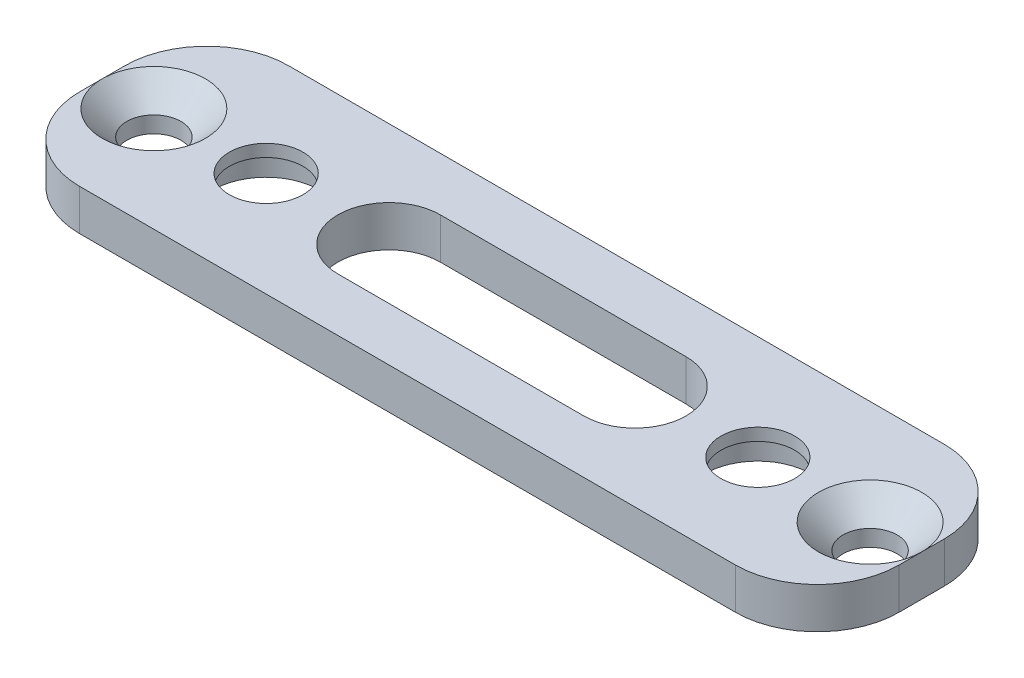
ISO-10303-21;
HEADER;
FILE_DESCRIPTION(('STEP AP214'),'2;1');
FILE_NAME('part.step','',(''),(''),'','','');
FILE_SCHEMA(('AUTOMOTIVE_DESIGN { 1 0 10303 214 1 1 1 1 }'));
ENDSEC;
DATA;
#1=APPLICATION_CONTEXT('core data for automotive mechanical design processes');
#2=APPLICATION_PROTOCOL_DEFINITION('international standard','automotive_design',2000,#1);
#3=PRODUCT_CONTEXT('',#1,'mechanical');
#4=PRODUCT('Part','Part','',(#3));
#5=PRODUCT_RELATED_PRODUCT_CATEGORY('part','',(#4));
#6=PRODUCT_DEFINITION_FORMATION('','',#4);
#7=PRODUCT_DEFINITION_CONTEXT('part definition',#1,'design');
#8=PRODUCT_DEFINITION('design','',#6,#7);
#9=PRODUCT_DEFINITION_SHAPE('','',#8);
#10=(LENGTH_UNIT() NAMED_UNIT(*) SI_UNIT(.MILLI.,.METRE.));
#11=(NAMED_UNIT(*) PLANE_ANGLE_UNIT() SI_UNIT($,.RADIAN.));
#12=(NAMED_UNIT(*) SI_UNIT($,.STERADIAN.) SOLID_ANGLE_UNIT());
#13=UNCERTAINTY_MEASURE_WITH_UNIT(LENGTH_MEASURE(1.E-05),#10,'distance_accuracy_value','');
#14=(GEOMETRIC_REPRESENTATION_CONTEXT(3) GLOBAL_UNCERTAINTY_ASSIGNED_CONTEXT((#13)) GLOBAL_UNIT_ASSIGNED_CONTEXT((#10,
#11,#12)) REPRESENTATION_CONTEXT('',''));
#15=CARTESIAN_POINT('',(0.,0.,0.));
#16=DIRECTION('',(0.,0.,1.));
#17=DIRECTION('',(1.,0.,0.));
#18=AXIS2_PLACEMENT_3D('',#15,#16,#17);
#19=CARTESIAN_POINT('',(0.,6.99999999999999,25.5));
#20=DIRECTION('',(1.,0.,0.));
#21=DIRECTION('',(0.,0.,-1.));
#22=AXIS2_PLACEMENT_3D('',#19,#20,#21);
#23=PLANE('',#22);
#24=DIRECTION('',(0.,0.,-1.));
#25=VECTOR('',#24,1.);
#26=CARTESIAN_POINT('',(0.,6.99999999999999,25.5));
#27=LINE('',#26,#25);
#28=CARTESIAN_POINT('',(0.,6.99999999999999,12.6078034261404));
#29=VERTEX_POINT('',#28);
#30=CARTESIAN_POINT('',(0.,6.99999999999999,10.));
#31=VERTEX_POINT('',#30);
#32=EDGE_CURVE('E229',#29,#31,#27,.T.);
#33=ORIENTED_EDGE('',*,*,#32,.T.);
#34=DIRECTION('',(0.,-1.,0.));
#35=VECTOR('',#34,1.);
#36=CARTESIAN_POINT('',(0.,6.99999999999999,10.));
#37=LINE('',#36,#35);
#38=CARTESIAN_POINT('',(0.,2.,10.));
#39=VERTEX_POINT('',#38);
#40=EDGE_CURVE('E11',#31,#39,#37,.T.);
#41=ORIENTED_EDGE('',*,*,#40,.T.);
#42=DIRECTION('',(0.,0.,-1.));
#43=VECTOR('',#42,1.);
#44=CARTESIAN_POINT('',(0.,2.,0.));
#45=LINE('',#44,#43);
#46=CARTESIAN_POINT('',(0.,2.,15.5));
#47=VERTEX_POINT('',#46);
#48=EDGE_CURVE('E172',#47,#39,#45,.T.);
#49=ORIENTED_EDGE('',*,*,#48,.F.);
#50=DIRECTION('',(0.,-1.,0.));
#51=VECTOR('',#50,1.);
#52=CARTESIAN_POINT('',(0.,6.99999999999999,15.5));
#53=LINE('',#52,#51);
#54=CARTESIAN_POINT('',(0.,6.99999999999999,15.5));
#55=VERTEX_POINT('',#54);
#56=EDGE_CURVE('E41',#47,#55,#53,.F.);
#57=ORIENTED_EDGE('',*,*,#56,.T.);
#58=CARTESIAN_POINT('',(0.,6.99999999999999,12.8921965738595));
#59=VERTEX_POINT('',#58);
#60=EDGE_CURVE('E242',#55,#59,#27,.T.);
#61=ORIENTED_EDGE('',*,*,#60,.T.);
#62=CARTESIAN_POINT('',(0.,6.99999999999999,12.8921965738595));
#63=CARTESIAN_POINT('',(0.,6.99679049752104,12.75));
#64=CARTESIAN_POINT('',(0.,6.99999999999999,12.6078034261405));
#65=B_SPLINE_CURVE_WITH_KNOTS('',2,(#62,#63,#64),.UNSPECIFIED.,.F.,.F.,(3,3),(0.,1.),.UNSPECIFIED.);
#66=EDGE_CURVE('E246',#59,#29,#65,.T.);
#67=ORIENTED_EDGE('',*,*,#66,.T.);
#68=EDGE_LOOP('',(#33,#41,#49,#57,#61,#67));
#69=FACE_BOUND('',#68,.T.);
#70=ADVANCED_FACE('F33',(#69),#23,.F.);
#71=CARTESIAN_POINT('',(100.,0.,25.5));
#72=DIRECTION('',(-1.,0.,0.));
#73=DIRECTION('',(0.,0.,1.));
#74=AXIS2_PLACEMENT_3D('',#71,#72,#73);
#75=PLANE('',#74);
#76=DIRECTION('',(0.,0.,-1.));
#77=VECTOR('',#76,1.);
#78=CARTESIAN_POINT('',(100.,7.,25.5));
#79=LINE('',#78,#77);
#80=CARTESIAN_POINT('',(100.,7.,15.5));
#81=VERTEX_POINT('',#80);
#82=CARTESIAN_POINT('',(100.,7.,12.75));
#83=VERTEX_POINT('',#82);
#84=EDGE_CURVE('E235',#81,#83,#79,.T.);
#85=ORIENTED_EDGE('',*,*,#84,.F.);
#86=DIRECTION('',(0.,1.,0.));
#87=VECTOR('',#86,1.);
#88=CARTESIAN_POINT('',(100.,2.,15.5));
#89=LINE('',#88,#87);
#90=CARTESIAN_POINT('',(100.,2.,15.5));
#91=VERTEX_POINT('',#90);
#92=EDGE_CURVE('E260',#81,#91,#89,.F.);
#93=ORIENTED_EDGE('',*,*,#92,.T.);
#94=DIRECTION('',(0.,0.,1.));
#95=VECTOR('',#94,1.);
#96=CARTESIAN_POINT('',(100.,2.,0.));
#97=LINE('',#96,#95);
#98=CARTESIAN_POINT('',(100.,2.,10.));
#99=VERTEX_POINT('',#98);
#100=EDGE_CURVE('E179',#99,#91,#97,.T.);
#101=ORIENTED_EDGE('',*,*,#100,.F.);
#102=DIRECTION('',(0.,1.,0.));
#103=VECTOR('',#102,1.);
#104=CARTESIAN_POINT('',(100.,0.,10.));
#105=LINE('',#104,#103);
#106=CARTESIAN_POINT('',(100.,7.,10.));
#107=VERTEX_POINT('',#106);
#108=EDGE_CURVE('E257',#99,#107,#105,.T.);
#109=ORIENTED_EDGE('',*,*,#108,.T.);
#110=EDGE_CURVE('E245',#83,#107,#79,.T.);
#111=ORIENTED_EDGE('',*,*,#110,.F.);
#112=EDGE_LOOP('',(#85,#93,#101,#109,#111));
#113=FACE_BOUND('',#112,.T.);
#114=ADVANCED_FACE('F319',(#113),#75,.F.);
#115=CARTESIAN_POINT('',(100.,7.,25.5));
#116=DIRECTION('',(0.,-1.,0.));
#117=DIRECTION('',(1.,0.,0.));
#118=AXIS2_PLACEMENT_3D('',#115,#116,#117);
#119=PLANE('',#118);
#120=DIRECTION('',(1.,0.,0.));
#121=VECTOR('',#120,1.);
#122=CARTESIAN_POINT('',(35.,6.99999999999999,19.));
#123=LINE('',#122,#121);
#124=CARTESIAN_POINT('',(35.,6.99999999999999,19.));
#125=VERTEX_POINT('',#124);
#126=CARTESIAN_POINT('',(65.,7.,19.));
#127=VERTEX_POINT('',#126);
#128=EDGE_CURVE('E166',#125,#127,#123,.T.);
#129=ORIENTED_EDGE('',*,*,#128,.F.);
#130=CARTESIAN_POINT('',(35.,6.99999999999999,12.75));
#131=DIRECTION('',(0.,1.,0.));
#132=DIRECTION('',(-1.,0.,0.));
#133=AXIS2_PLACEMENT_3D('',#130,#131,#132);
#134=CIRCLE('',#133,6.25);
#135=CARTESIAN_POINT('',(35.,6.99999999999999,6.49999999999999));
#136=VERTEX_POINT('',#135);
#137=EDGE_CURVE('E139',#136,#125,#134,.T.);
#138=ORIENTED_EDGE('',*,*,#137,.F.);
#139=DIRECTION('',(-1.,0.,0.));
#140=VECTOR('',#139,1.);
#141=CARTESIAN_POINT('',(35.,6.99999999999999,6.49999999999999));
#142=LINE('',#141,#140);
#143=CARTESIAN_POINT('',(65.,7.,6.49999999999999));
#144=VERTEX_POINT('',#143);
#145=EDGE_CURVE('E157',#144,#136,#142,.T.);
#146=ORIENTED_EDGE('',*,*,#145,.F.);
#147=CARTESIAN_POINT('',(65.,7.,12.75));
#148=DIRECTION('',(0.,1.,0.));
#149=DIRECTION('',(-1.,0.,0.));
#150=AXIS2_PLACEMENT_3D('',#147,#148,#149);
#151=CIRCLE('',#150,6.25);
#152=EDGE_CURVE('E160',#127,#144,#151,.T.);
#153=ORIENTED_EDGE('',*,*,#152,.F.);
#154=EDGE_LOOP('',(#129,#138,#146,#153));
#155=FACE_BOUND('',#154,.T.);
#156=CARTESIAN_POINT('',(80.,7.,12.75));
#157=DIRECTION('',(0.,1.,0.));
#158=DIRECTION('',(-1.,0.,0.));
#159=AXIS2_PLACEMENT_3D('',#156,#157,#158);
#160=CIRCLE('',#159,4.5);
#161=CARTESIAN_POINT('',(75.5,7.,12.75));
#162=VERTEX_POINT('',#161);
#163=EDGE_CURVE('E203',#162,#162,#160,.T.);
#164=ORIENTED_EDGE('',*,*,#163,.F.);
#165=EDGE_LOOP('',(#164));
#166=FACE_BOUND('',#165,.T.);
#167=CARTESIAN_POINT('',(20.,6.99999999999999,12.75));
#168=DIRECTION('',(0.,1.,0.));
#169=DIRECTION('',(-1.,0.,0.));
#170=AXIS2_PLACEMENT_3D('',#167,#168,#169);
#171=CIRCLE('',#170,4.5);
#172=CARTESIAN_POINT('',(15.5,6.99999999999999,12.75));
#173=VERTEX_POINT('',#172);
#174=EDGE_CURVE('E206',#173,#173,#171,.T.);
#175=ORIENTED_EDGE('',*,*,#174,.F.);
#176=EDGE_LOOP('',(#175));
#177=FACE_BOUND('',#176,.T.);
#178=DIRECTION('',(-1.,0.,0.));
#179=VECTOR('',#178,1.);
#180=CARTESIAN_POINT('',(100.,7.,25.5));
#181=LINE('',#180,#179);
#182=CARTESIAN_POINT('',(90.,7.,25.5));
#183=VERTEX_POINT('',#182);
#184=CARTESIAN_POINT('',(9.99999999999999,6.99999999999999,25.5));
#185=VERTEX_POINT('',#184);
#186=EDGE_CURVE('E226',#183,#185,#181,.T.);
#187=ORIENTED_EDGE('',*,*,#186,.F.);
#188=CARTESIAN_POINT('',(90.,7.,15.5));
#189=DIRECTION('',(0.,-1.,0.));
#190=DIRECTION('',(1.,0.,0.));
#191=AXIS2_PLACEMENT_3D('',#188,#189,#190);
#192=CIRCLE('',#191,10.);
#193=EDGE_CURVE('E255',#183,#81,#192,.F.);
#194=ORIENTED_EDGE('',*,*,#193,.T.);
#195=ORIENTED_EDGE('',*,*,#84,.T.);
#196=CARTESIAN_POINT('',(93.7,7.,12.75));
#197=DIRECTION('',(0.,1.,0.));
#198=DIRECTION('',(0.,0.,1.));
#199=AXIS2_PLACEMENT_3D('',#196,#197,#198);
#200=CIRCLE('',#199,6.3);
#201=EDGE_CURVE('E209',#83,#83,#200,.T.);
#202=ORIENTED_EDGE('',*,*,#201,.F.);
#203=ORIENTED_EDGE('',*,*,#110,.T.);
#204=CARTESIAN_POINT('',(90.,7.,10.));
#205=DIRECTION('',(0.,-1.,0.));
#206=DIRECTION('',(1.,0.,0.));
#207=AXIS2_PLACEMENT_3D('',#204,#205,#206);
#208=CIRCLE('',#207,10.);
#209=CARTESIAN_POINT('',(90.,7.,0.));
#210=VERTEX_POINT('',#209);
#211=EDGE_CURVE('E253',#107,#210,#208,.F.);
#212=ORIENTED_EDGE('',*,*,#211,.T.);
#213=DIRECTION('',(-1.,0.,0.));
#214=VECTOR('',#213,1.);
#215=CARTESIAN_POINT('',(100.,7.,0.));
#216=LINE('',#215,#214);
#217=CARTESIAN_POINT('',(9.99999999999999,6.99999999999999,0.));
#218=VERTEX_POINT('',#217);
#219=EDGE_CURVE('E230',#210,#218,#216,.T.);
#220=ORIENTED_EDGE('',*,*,#219,.T.);
#221=CARTESIAN_POINT('',(10.,6.99999999999999,10.));
#222=DIRECTION('',(0.,-1.,0.));
#223=DIRECTION('',(1.,0.,0.));
#224=AXIS2_PLACEMENT_3D('',#221,#222,#223);
#225=CIRCLE('',#224,10.);
#226=EDGE_CURVE('E251',#218,#31,#225,.F.);
#227=ORIENTED_EDGE('',*,*,#226,.T.);
#228=ORIENTED_EDGE('',*,*,#32,.F.);
#229=CARTESIAN_POINT('',(6.29839504432539,6.99999999999999,12.75));
#230=DIRECTION('',(0.,1.,0.));
#231=DIRECTION('',(0.,0.,1.));
#232=AXIS2_PLACEMENT_3D('',#229,#230,#231);
#233=CIRCLE('',#232,6.3);
#234=EDGE_CURVE('E215',#59,#29,#233,.T.);
#235=ORIENTED_EDGE('',*,*,#234,.F.);
#236=ORIENTED_EDGE('',*,*,#60,.F.);
#237=CARTESIAN_POINT('',(10.,6.99999999999999,15.5));
#238=DIRECTION('',(0.,-1.,0.));
#239=DIRECTION('',(1.,0.,0.));
#240=AXIS2_PLACEMENT_3D('',#237,#238,#239);
#241=CIRCLE('',#240,10.);
#242=EDGE_CURVE('E249',#55,#185,#241,.F.);
#243=ORIENTED_EDGE('',*,*,#242,.T.);
#244=EDGE_LOOP('',(#187,#194,#195,#202,#203,#212,#220,#227,#228,#235,#236,#243));
#245=FACE_BOUND('',#244,.T.);
#246=ADVANCED_FACE('F283',(#155,#166,#177,#245),#119,.F.);
#247=CARTESIAN_POINT('',(0.,0.,25.5));
#248=DIRECTION('',(0.,0.,1.));
#249=DIRECTION('',(1.,0.,0.));
#250=AXIS2_PLACEMENT_3D('',#247,#248,#249);
#251=PLANE('',#250);
#252=DIRECTION('',(-1.,0.,0.));
#253=VECTOR('',#252,1.);
#254=CARTESIAN_POINT('',(0.,2.,25.5));
#255=LINE('',#254,#253);
#256=CARTESIAN_POINT('',(90.,2.,25.5));
#257=VERTEX_POINT('',#256);
#258=CARTESIAN_POINT('',(10.,2.,25.5));
#259=VERTEX_POINT('',#258);
#260=EDGE_CURVE('E182',#257,#259,#255,.T.);
#261=ORIENTED_EDGE('',*,*,#260,.F.);
#262=DIRECTION('',(0.,1.,0.));
#263=VECTOR('',#262,1.);
#264=CARTESIAN_POINT('',(90.,7.,25.5));
#265=LINE('',#264,#263);
#266=EDGE_CURVE('E247',#257,#183,#265,.T.);
#267=ORIENTED_EDGE('',*,*,#266,.T.);
#268=ORIENTED_EDGE('',*,*,#186,.T.);
#269=DIRECTION('',(0.,-1.,0.));
#270=VECTOR('',#269,1.);
#271=CARTESIAN_POINT('',(10.,2.,25.5));
#272=LINE('',#271,#270);
#273=EDGE_CURVE('E287',#185,#259,#272,.T.);
#274=ORIENTED_EDGE('',*,*,#273,.T.);
#275=EDGE_LOOP('',(#261,#267,#268,#274));
#276=FACE_BOUND('',#275,.T.);
#277=ADVANCED_FACE('F347',(#276),#251,.T.);
#278=CARTESIAN_POINT('',(0.,0.,0.));
#279=DIRECTION('',(0.,0.,1.));
#280=DIRECTION('',(1.,0.,0.));
#281=AXIS2_PLACEMENT_3D('',#278,#279,#280);
#282=PLANE('',#281);
#283=ORIENTED_EDGE('',*,*,#219,.F.);
#284=DIRECTION('',(0.,1.,0.));
#285=VECTOR('',#284,1.);
#286=CARTESIAN_POINT('',(90.,0.,0.));
#287=LINE('',#286,#285);
#288=CARTESIAN_POINT('',(90.,2.,0.));
#289=VERTEX_POINT('',#288);
#290=EDGE_CURVE('E48',#210,#289,#287,.F.);
#291=ORIENTED_EDGE('',*,*,#290,.T.);
#292=DIRECTION('',(1.,0.,0.));
#293=VECTOR('',#292,1.);
#294=CARTESIAN_POINT('',(0.,2.,0.));
#295=LINE('',#294,#293);
#296=CARTESIAN_POINT('',(10.,2.,0.));
#297=VERTEX_POINT('',#296);
#298=EDGE_CURVE('E177',#297,#289,#295,.T.);
#299=ORIENTED_EDGE('',*,*,#298,.F.);
#300=DIRECTION('',(0.,-1.,0.));
#301=VECTOR('',#300,1.);
#302=CARTESIAN_POINT('',(10.,0.,0.));
#303=LINE('',#302,#301);
#304=EDGE_CURVE('E269',#297,#218,#303,.F.);
#305=ORIENTED_EDGE('',*,*,#304,.T.);
#306=EDGE_LOOP('',(#283,#291,#299,#305));
#307=FACE_BOUND('',#306,.T.);
#308=ADVANCED_FACE('F375',(#307),#282,.F.);
#309=CARTESIAN_POINT('',(6.29839504432539,6.99999999999999,12.75));
#310=DIRECTION('',(0.,1.,0.));
#311=DIRECTION('',(0.,0.,1.));
#312=AXIS2_PLACEMENT_3D('',#309,#310,#311);
#313=CONICAL_SURFACE('',#312,6.3,0.785398163397448);
#314=CARTESIAN_POINT('',(6.29839504432539,3.99999999999999,12.75));
#315=DIRECTION('',(0.,1.,0.));
#316=DIRECTION('',(0.,0.,1.));
#317=AXIS2_PLACEMENT_3D('',#314,#315,#316);
#318=CIRCLE('',#317,3.3);
#319=CARTESIAN_POINT('',(6.29839504432539,3.99999999999999,16.05));
#320=VERTEX_POINT('',#319);
#321=EDGE_CURVE('E218',#320,#320,#318,.T.);
#322=ORIENTED_EDGE('',*,*,#321,.F.);
#323=EDGE_LOOP('',(#322));
#324=FACE_BOUND('',#323,.T.);
#325=ORIENTED_EDGE('',*,*,#234,.T.);
#326=ORIENTED_EDGE('',*,*,#66,.F.);
#327=EDGE_LOOP('',(#325,#326));
#328=FACE_BOUND('',#327,.T.);
#329=ADVANCED_FACE('F371',(#324,#328),#313,.F.);
#330=CARTESIAN_POINT('',(6.29839504432539,6.99999999999999,12.75));
#331=DIRECTION('',(0.,1.,0.));
#332=DIRECTION('',(0.,0.,1.));
#333=AXIS2_PLACEMENT_3D('',#330,#331,#332);
#334=CYLINDRICAL_SURFACE('',#333,3.3);
#335=CARTESIAN_POINT('',(6.29839504432539,2.,12.75));
#336=DIRECTION('',(0.,1.,0.));
#337=DIRECTION('',(0.,0.,1.));
#338=AXIS2_PLACEMENT_3D('',#335,#336,#337);
#339=CIRCLE('',#338,3.3);
#340=CARTESIAN_POINT('',(6.29839504432539,2.,16.05));
#341=VERTEX_POINT('',#340);
#342=EDGE_CURVE('E192',#341,#341,#339,.F.);
#343=ORIENTED_EDGE('',*,*,#342,.T.);
#344=EDGE_LOOP('',(#343));
#345=FACE_BOUND('',#344,.T.);
#346=ORIENTED_EDGE('',*,*,#321,.T.);
#347=EDGE_LOOP('',(#346));
#348=FACE_BOUND('',#347,.T.);
#349=ADVANCED_FACE('F367',(#345,#348),#334,.F.);
#350=CARTESIAN_POINT('',(93.7,7.,12.75));
#351=DIRECTION('',(0.,1.,0.));
#352=DIRECTION('',(0.,0.,1.));
#353=AXIS2_PLACEMENT_3D('',#350,#351,#352);
#354=CYLINDRICAL_SURFACE('',#353,3.3);
#355=CARTESIAN_POINT('',(93.7,2.,12.75));
#356=DIRECTION('',(0.,1.,0.));
#357=DIRECTION('',(0.,0.,1.));
#358=AXIS2_PLACEMENT_3D('',#355,#356,#357);
#359=CIRCLE('',#358,3.3);
#360=CARTESIAN_POINT('',(93.7,2.,16.05));
#361=VERTEX_POINT('',#360);
#362=EDGE_CURVE('E189',#361,#361,#359,.F.);
#363=ORIENTED_EDGE('',*,*,#362,.T.);
#364=EDGE_LOOP('',(#363));
#365=FACE_BOUND('',#364,.T.);
#366=CARTESIAN_POINT('',(93.7,4.,12.75));
#367=DIRECTION('',(0.,1.,0.));
#368=DIRECTION('',(0.,0.,1.));
#369=AXIS2_PLACEMENT_3D('',#366,#367,#368);
#370=CIRCLE('',#369,3.3);
#371=CARTESIAN_POINT('',(93.7,4.,16.05));
#372=VERTEX_POINT('',#371);
#373=EDGE_CURVE('E212',#372,#372,#370,.T.);
#374=ORIENTED_EDGE('',*,*,#373,.T.);
#375=EDGE_LOOP('',(#374));
#376=FACE_BOUND('',#375,.T.);
#377=ADVANCED_FACE('F359',(#365,#376),#354,.F.);
#378=CARTESIAN_POINT('',(93.7,7.,12.75));
#379=DIRECTION('',(0.,1.,0.));
#380=DIRECTION('',(0.,0.,1.));
#381=AXIS2_PLACEMENT_3D('',#378,#379,#380);
#382=CONICAL_SURFACE('',#381,6.3,0.785398163397448);
#383=ORIENTED_EDGE('',*,*,#373,.F.);
#384=EDGE_LOOP('',(#383));
#385=FACE_BOUND('',#384,.T.);
#386=ORIENTED_EDGE('',*,*,#201,.T.);
#387=EDGE_LOOP('',(#386));
#388=FACE_BOUND('',#387,.T.);
#389=ADVANCED_FACE('F357',(#385,#388),#382,.F.);
#390=CARTESIAN_POINT('',(20.,3.99999999999999,12.75));
#391=DIRECTION('',(0.,1.,0.));
#392=DIRECTION('',(-1.,0.,0.));
#393=AXIS2_PLACEMENT_3D('',#390,#391,#392);
#394=CYLINDRICAL_SURFACE('',#393,4.5);
#395=CARTESIAN_POINT('',(20.,5.49999999999999,12.75));
#396=DIRECTION('',(0.,1.,0.));
#397=DIRECTION('',(-1.,0.,0.));
#398=AXIS2_PLACEMENT_3D('',#395,#396,#397);
#399=CIRCLE('',#398,4.5);
#400=CARTESIAN_POINT('',(15.5,5.49999999999999,12.75));
#401=VERTEX_POINT('',#400);
#402=EDGE_CURVE('E202',#401,#401,#399,.F.);
#403=ORIENTED_EDGE('',*,*,#402,.T.);
#404=EDGE_LOOP('',(#403));
#405=FACE_BOUND('',#404,.T.);
#406=ORIENTED_EDGE('',*,*,#174,.T.);
#407=EDGE_LOOP('',(#406));
#408=FACE_BOUND('',#407,.T.);
#409=ADVANCED_FACE('F298',(#405,#408),#394,.F.);
#410=CARTESIAN_POINT('',(80.,4.,12.75));
#411=DIRECTION('',(0.,1.,0.));
#412=DIRECTION('',(-1.,0.,0.));
#413=AXIS2_PLACEMENT_3D('',#410,#411,#412);
#414=CYLINDRICAL_SURFACE('',#413,4.5);
#415=CARTESIAN_POINT('',(80.,5.5,12.75));
#416=DIRECTION('',(0.,1.,0.));
#417=DIRECTION('',(-1.,0.,0.));
#418=AXIS2_PLACEMENT_3D('',#415,#416,#417);
#419=CIRCLE('',#418,4.5);
#420=CARTESIAN_POINT('',(75.5,5.5,12.75));
#421=VERTEX_POINT('',#420);
#422=EDGE_CURVE('E198',#421,#421,#419,.F.);
#423=ORIENTED_EDGE('',*,*,#422,.T.);
#424=EDGE_LOOP('',(#423));
#425=FACE_BOUND('',#424,.T.);
#426=ORIENTED_EDGE('',*,*,#163,.T.);
#427=EDGE_LOOP('',(#426));
#428=FACE_BOUND('',#427,.T.);
#429=ADVANCED_FACE('F304',(#425,#428),#414,.F.);
#430=CARTESIAN_POINT('',(20.,5.49999999999999,12.75));
#431=DIRECTION('',(0.,1.,0.));
#432=DIRECTION('',(-1.,0.,0.));
#433=AXIS2_PLACEMENT_3D('',#430,#431,#432);
#434=PLANE('',#433);
#435=CARTESIAN_POINT('',(20.,5.49999999999999,12.75));
#436=DIRECTION('',(0.,1.,0.));
#437=DIRECTION('',(-1.,0.,0.));
#438=AXIS2_PLACEMENT_3D('',#435,#436,#437);
#439=CIRCLE('',#438,6.5);
#440=CARTESIAN_POINT('',(13.5,5.49999999999999,12.75));
#441=VERTEX_POINT('',#440);
#442=EDGE_CURVE('E199',#441,#441,#439,.T.);
#443=ORIENTED_EDGE('',*,*,#442,.F.);
#444=EDGE_LOOP('',(#443));
#445=FACE_BOUND('',#444,.T.);
#446=ORIENTED_EDGE('',*,*,#402,.F.);
#447=EDGE_LOOP('',(#446));
#448=FACE_BOUND('',#447,.T.);
#449=ADVANCED_FACE('F301',(#445,#448),#434,.F.);
#450=CARTESIAN_POINT('',(20.,5.49999999999999,12.75));
#451=DIRECTION('',(0.,-1.,0.));
#452=DIRECTION('',(1.,0.,0.));
#453=AXIS2_PLACEMENT_3D('',#450,#451,#452);
#454=CYLINDRICAL_SURFACE('',#453,6.5);
#455=CARTESIAN_POINT('',(20.,2.,12.75));
#456=DIRECTION('',(0.,1.,0.));
#457=DIRECTION('',(0.,0.,1.));
#458=AXIS2_PLACEMENT_3D('',#455,#456,#457);
#459=CIRCLE('',#458,6.5);
#460=CARTESIAN_POINT('',(20.,2.,19.25));
#461=VERTEX_POINT('',#460);
#462=EDGE_CURVE('E186',#461,#461,#459,.T.);
#463=ORIENTED_EDGE('',*,*,#462,.F.);
#464=EDGE_LOOP('',(#463));
#465=FACE_BOUND('',#464,.T.);
#466=ORIENTED_EDGE('',*,*,#442,.T.);
#467=EDGE_LOOP('',(#466));
#468=FACE_BOUND('',#467,.T.);
#469=ADVANCED_FACE('F303',(#465,#468),#454,.F.);
#470=CARTESIAN_POINT('',(80.,5.5,12.75));
#471=DIRECTION('',(0.,1.,0.));
#472=DIRECTION('',(-1.,0.,0.));
#473=AXIS2_PLACEMENT_3D('',#470,#471,#472);
#474=PLANE('',#473);
#475=CARTESIAN_POINT('',(80.,5.5,12.75));
#476=DIRECTION('',(0.,1.,0.));
#477=DIRECTION('',(-1.,0.,0.));
#478=AXIS2_PLACEMENT_3D('',#475,#476,#477);
#479=CIRCLE('',#478,6.5);
#480=CARTESIAN_POINT('',(73.5,5.5,12.75));
#481=VERTEX_POINT('',#480);
#482=EDGE_CURVE('E195',#481,#481,#479,.T.);
#483=ORIENTED_EDGE('',*,*,#482,.F.);
#484=EDGE_LOOP('',(#483));
#485=FACE_BOUND('',#484,.T.);
#486=ORIENTED_EDGE('',*,*,#422,.F.);
#487=EDGE_LOOP('',(#486));
#488=FACE_BOUND('',#487,.T.);
#489=ADVANCED_FACE('F311',(#485,#488),#474,.F.);
#490=CARTESIAN_POINT('',(80.,5.5,12.75));
#491=DIRECTION('',(0.,-1.,0.));
#492=DIRECTION('',(1.,0.,0.));
#493=AXIS2_PLACEMENT_3D('',#490,#491,#492);
#494=CYLINDRICAL_SURFACE('',#493,6.5);
#495=CARTESIAN_POINT('',(80.,2.,12.75));
#496=DIRECTION('',(0.,1.,0.));
#497=DIRECTION('',(0.,0.,1.));
#498=AXIS2_PLACEMENT_3D('',#495,#496,#497);
#499=CIRCLE('',#498,6.5);
#500=CARTESIAN_POINT('',(80.,2.,19.25));
#501=VERTEX_POINT('',#500);
#502=EDGE_CURVE('E185',#501,#501,#499,.T.);
#503=ORIENTED_EDGE('',*,*,#502,.F.);
#504=EDGE_LOOP('',(#503));
#505=FACE_BOUND('',#504,.T.);
#506=ORIENTED_EDGE('',*,*,#482,.T.);
#507=EDGE_LOOP('',(#506));
#508=FACE_BOUND('',#507,.T.);
#509=ADVANCED_FACE('F411',(#505,#508),#494,.F.);
#510=CARTESIAN_POINT('',(0.,2.,0.));
#511=DIRECTION('',(0.,1.,0.));
#512=DIRECTION('',(0.,0.,1.));
#513=AXIS2_PLACEMENT_3D('',#510,#511,#512);
#514=PLANE('',#513);
#515=DIRECTION('',(-1.,0.,0.));
#516=VECTOR('',#515,1.);
#517=CARTESIAN_POINT('',(35.,1.99999999999999,6.49999999999999));
#518=LINE('',#517,#516);
#519=CARTESIAN_POINT('',(65.,2.,6.49999999999999));
#520=VERTEX_POINT('',#519);
#521=CARTESIAN_POINT('',(35.,1.99999999999999,6.49999999999999));
#522=VERTEX_POINT('',#521);
#523=EDGE_CURVE('E144',#520,#522,#518,.T.);
#524=ORIENTED_EDGE('',*,*,#523,.T.);
#525=CARTESIAN_POINT('',(35.,1.99999999999999,12.75));
#526=DIRECTION('',(0.,1.,0.));
#527=DIRECTION('',(-1.,0.,0.));
#528=AXIS2_PLACEMENT_3D('',#525,#526,#527);
#529=CIRCLE('',#528,6.25);
#530=CARTESIAN_POINT('',(35.,1.99999999999999,19.));
#531=VERTEX_POINT('',#530);
#532=EDGE_CURVE('E136',#522,#531,#529,.T.);
#533=ORIENTED_EDGE('',*,*,#532,.T.);
#534=DIRECTION('',(1.,0.,0.));
#535=VECTOR('',#534,1.);
#536=CARTESIAN_POINT('',(35.,1.99999999999999,19.));
#537=LINE('',#536,#535);
#538=CARTESIAN_POINT('',(65.,2.,19.));
#539=VERTEX_POINT('',#538);
#540=EDGE_CURVE('E148',#531,#539,#537,.T.);
#541=ORIENTED_EDGE('',*,*,#540,.T.);
#542=CARTESIAN_POINT('',(65.,2.,12.75));
#543=DIRECTION('',(0.,1.,0.));
#544=DIRECTION('',(-1.,0.,0.));
#545=AXIS2_PLACEMENT_3D('',#542,#543,#544);
#546=CIRCLE('',#545,6.25);
#547=EDGE_CURVE('E152',#539,#520,#546,.T.);
#548=ORIENTED_EDGE('',*,*,#547,.T.);
#549=EDGE_LOOP('',(#524,#533,#541,#548));
#550=FACE_BOUND('',#549,.T.);
#551=ORIENTED_EDGE('',*,*,#362,.F.);
#552=EDGE_LOOP('',(#551));
#553=FACE_BOUND('',#552,.T.);
#554=ORIENTED_EDGE('',*,*,#462,.T.);
#555=EDGE_LOOP('',(#554));
#556=FACE_BOUND('',#555,.T.);
#557=ORIENTED_EDGE('',*,*,#502,.T.);
#558=EDGE_LOOP('',(#557));
#559=FACE_BOUND('',#558,.T.);
#560=ORIENTED_EDGE('',*,*,#100,.T.);
#561=CARTESIAN_POINT('',(90.,2.,15.5));
#562=DIRECTION('',(0.,1.,0.));
#563=DIRECTION('',(0.,0.,1.));
#564=AXIS2_PLACEMENT_3D('',#561,#562,#563);
#565=CIRCLE('',#564,10.);
#566=EDGE_CURVE('E267',#91,#257,#565,.F.);
#567=ORIENTED_EDGE('',*,*,#566,.T.);
#568=ORIENTED_EDGE('',*,*,#260,.T.);
#569=CARTESIAN_POINT('',(10.,2.,15.5));
#570=DIRECTION('',(0.,1.,0.));
#571=DIRECTION('',(0.,0.,1.));
#572=AXIS2_PLACEMENT_3D('',#569,#570,#571);
#573=CIRCLE('',#572,10.);
#574=EDGE_CURVE('E262',#259,#47,#573,.F.);
#575=ORIENTED_EDGE('',*,*,#574,.T.);
#576=ORIENTED_EDGE('',*,*,#48,.T.);
#577=CARTESIAN_POINT('',(10.,2.,10.));
#578=DIRECTION('',(0.,1.,0.));
#579=DIRECTION('',(0.,0.,1.));
#580=AXIS2_PLACEMENT_3D('',#577,#578,#579);
#581=CIRCLE('',#580,10.);
#582=EDGE_CURVE('E55',#39,#297,#581,.F.);
#583=ORIENTED_EDGE('',*,*,#582,.T.);
#584=ORIENTED_EDGE('',*,*,#298,.T.);
#585=CARTESIAN_POINT('',(90.,2.,10.));
#586=DIRECTION('',(0.,1.,0.));
#587=DIRECTION('',(0.,0.,1.));
#588=AXIS2_PLACEMENT_3D('',#585,#586,#587);
#589=CIRCLE('',#588,10.);
#590=EDGE_CURVE('E265',#289,#99,#589,.F.);
#591=ORIENTED_EDGE('',*,*,#590,.T.);
#592=EDGE_LOOP('',(#560,#567,#568,#575,#576,#583,#584,#591));
#593=FACE_BOUND('',#592,.T.);
#594=ORIENTED_EDGE('',*,*,#342,.F.);
#595=EDGE_LOOP('',(#594));
#596=FACE_BOUND('',#595,.T.);
#597=ADVANCED_FACE('F154',(#550,#553,#556,#559,#593,#596),#514,.F.);
#598=CARTESIAN_POINT('',(35.,1.99999999999999,12.75));
#599=DIRECTION('',(0.,1.,0.));
#600=DIRECTION('',(-1.,0.,0.));
#601=AXIS2_PLACEMENT_3D('',#598,#599,#600);
#602=CYLINDRICAL_SURFACE('',#601,6.25);
#603=ORIENTED_EDGE('',*,*,#137,.T.);
#604=DIRECTION('',(0.,1.,0.));
#605=VECTOR('',#604,1.);
#606=CARTESIAN_POINT('',(35.,1.99999999999999,19.));
#607=LINE('',#606,#605);
#608=EDGE_CURVE('E132',#531,#125,#607,.T.);
#609=ORIENTED_EDGE('',*,*,#608,.F.);
#610=ORIENTED_EDGE('',*,*,#532,.F.);
#611=DIRECTION('',(0.,1.,0.));
#612=VECTOR('',#611,1.);
#613=CARTESIAN_POINT('',(35.,1.99999999999999,6.49999999999999));
#614=LINE('',#613,#612);
#615=EDGE_CURVE('E170',#522,#136,#614,.T.);
#616=ORIENTED_EDGE('',*,*,#615,.T.);
#617=EDGE_LOOP('',(#603,#609,#610,#616));
#618=FACE_BOUND('',#617,.T.);
#619=ADVANCED_FACE('F134',(#618),#602,.F.);
#620=CARTESIAN_POINT('',(35.,1.99999999999999,6.49999999999999));
#621=DIRECTION('',(0.,0.,-1.));
#622=DIRECTION('',(-1.,0.,0.));
#623=AXIS2_PLACEMENT_3D('',#620,#621,#622);
#624=PLANE('',#623);
#625=ORIENTED_EDGE('',*,*,#145,.T.);
#626=ORIENTED_EDGE('',*,*,#615,.F.);
#627=ORIENTED_EDGE('',*,*,#523,.F.);
#628=DIRECTION('',(0.,1.,0.));
#629=VECTOR('',#628,1.);
#630=CARTESIAN_POINT('',(65.,2.,6.49999999999999));
#631=LINE('',#630,#629);
#632=EDGE_CURVE('E173',#520,#144,#631,.T.);
#633=ORIENTED_EDGE('',*,*,#632,.T.);
#634=EDGE_LOOP('',(#625,#626,#627,#633));
#635=FACE_BOUND('',#634,.T.);
#636=ADVANCED_FACE('F397',(#635),#624,.F.);
#637=CARTESIAN_POINT('',(65.,2.,12.75));
#638=DIRECTION('',(0.,1.,0.));
#639=DIRECTION('',(-1.,0.,0.));
#640=AXIS2_PLACEMENT_3D('',#637,#638,#639);
#641=CYLINDRICAL_SURFACE('',#640,6.25);
#642=ORIENTED_EDGE('',*,*,#152,.T.);
#643=ORIENTED_EDGE('',*,*,#632,.F.);
#644=ORIENTED_EDGE('',*,*,#547,.F.);
#645=DIRECTION('',(0.,1.,0.));
#646=VECTOR('',#645,1.);
#647=CARTESIAN_POINT('',(65.,2.,19.));
#648=LINE('',#647,#646);
#649=EDGE_CURVE('E143',#539,#127,#648,.T.);
#650=ORIENTED_EDGE('',*,*,#649,.T.);
#651=EDGE_LOOP('',(#642,#643,#644,#650));
#652=FACE_BOUND('',#651,.T.);
#653=ADVANCED_FACE('F395',(#652),#641,.F.);
#654=CARTESIAN_POINT('',(35.,1.99999999999999,19.));
#655=DIRECTION('',(0.,0.,1.));
#656=DIRECTION('',(1.,0.,0.));
#657=AXIS2_PLACEMENT_3D('',#654,#655,#656);
#658=PLANE('',#657);
#659=ORIENTED_EDGE('',*,*,#128,.T.);
#660=ORIENTED_EDGE('',*,*,#649,.F.);
#661=ORIENTED_EDGE('',*,*,#540,.F.);
#662=ORIENTED_EDGE('',*,*,#608,.T.);
#663=EDGE_LOOP('',(#659,#660,#661,#662));
#664=FACE_BOUND('',#663,.T.);
#665=ADVANCED_FACE('F149',(#664),#658,.F.);
#666=CARTESIAN_POINT('',(90.,0.,15.5));
#667=DIRECTION('',(0.,-1.,0.));
#668=DIRECTION('',(0.,0.,-1.));
#669=AXIS2_PLACEMENT_3D('',#666,#667,#668);
#670=CYLINDRICAL_SURFACE('',#669,10.);
#671=ORIENTED_EDGE('',*,*,#566,.F.);
#672=ORIENTED_EDGE('',*,*,#92,.F.);
#673=ORIENTED_EDGE('',*,*,#193,.F.);
#674=ORIENTED_EDGE('',*,*,#266,.F.);
#675=EDGE_LOOP('',(#671,#672,#673,#674));
#676=FACE_BOUND('',#675,.T.);
#677=ADVANCED_FACE('F329',(#676),#670,.T.);
#678=CARTESIAN_POINT('',(90.,0.,10.));
#679=DIRECTION('',(0.,1.,0.));
#680=DIRECTION('',(0.,0.,1.));
#681=AXIS2_PLACEMENT_3D('',#678,#679,#680);
#682=CYLINDRICAL_SURFACE('',#681,10.);
#683=ORIENTED_EDGE('',*,*,#590,.F.);
#684=ORIENTED_EDGE('',*,*,#290,.F.);
#685=ORIENTED_EDGE('',*,*,#211,.F.);
#686=ORIENTED_EDGE('',*,*,#108,.F.);
#687=EDGE_LOOP('',(#683,#684,#685,#686));
#688=FACE_BOUND('',#687,.T.);
#689=ADVANCED_FACE('F543',(#688),#682,.T.);
#690=CARTESIAN_POINT('',(10.,6.99999999999999,10.));
#691=DIRECTION('',(0.,-1.,0.));
#692=DIRECTION('',(0.,0.,-1.));
#693=AXIS2_PLACEMENT_3D('',#690,#691,#692);
#694=CYLINDRICAL_SURFACE('',#693,10.);
#695=ORIENTED_EDGE('',*,*,#226,.F.);
#696=ORIENTED_EDGE('',*,*,#304,.F.);
#697=ORIENTED_EDGE('',*,*,#582,.F.);
#698=ORIENTED_EDGE('',*,*,#40,.F.);
#699=EDGE_LOOP('',(#695,#696,#697,#698));
#700=FACE_BOUND('',#699,.T.);
#701=ADVANCED_FACE('F343',(#700),#694,.T.);
#702=CARTESIAN_POINT('',(10.,0.,15.5));
#703=DIRECTION('',(0.,1.,0.));
#704=DIRECTION('',(0.,0.,1.));
#705=AXIS2_PLACEMENT_3D('',#702,#703,#704);
#706=CYLINDRICAL_SURFACE('',#705,10.);
#707=ORIENTED_EDGE('',*,*,#242,.F.);
#708=ORIENTED_EDGE('',*,*,#56,.F.);
#709=ORIENTED_EDGE('',*,*,#574,.F.);
#710=ORIENTED_EDGE('',*,*,#273,.F.);
#711=EDGE_LOOP('',(#707,#708,#709,#710));
#712=FACE_BOUND('',#711,.T.);
#713=ADVANCED_FACE('F35',(#712),#706,.T.);
#714=CLOSED_SHELL('',(#70,#114,#246,#277,#308,#329,#349,#377,#389,#409,#429,#449,#469,#489,#509,
#597,#619,#636,#653,#665,#677,#689,#701,#713));
#715=MANIFOLD_SOLID_BREP('B2',#714);
#716=ADVANCED_BREP_SHAPE_REPRESENTATION('',(#18,#715),#14);
#717=SHAPE_DEFINITION_REPRESENTATION(#9,#716);
ENDSEC;
END-ISO-10303-21;
